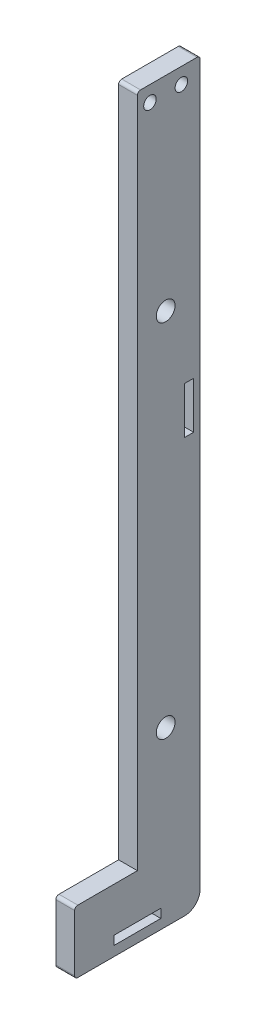
ISO-10303-21;
HEADER;
FILE_DESCRIPTION(('STEP AP214'),'2;1');
FILE_NAME('part.step','',(''),(''),'','','');
FILE_SCHEMA(('AUTOMOTIVE_DESIGN { 1 0 10303 214 1 1 1 1 }'));
ENDSEC;
DATA;
#1=APPLICATION_CONTEXT('core data for automotive mechanical design processes');
#2=APPLICATION_PROTOCOL_DEFINITION('international standard','automotive_design',2000,#1);
#3=PRODUCT_CONTEXT('',#1,'mechanical');
#4=PRODUCT('Part','Part','',(#3));
#5=PRODUCT_RELATED_PRODUCT_CATEGORY('part','',(#4));
#6=PRODUCT_DEFINITION_FORMATION('','',#4);
#7=PRODUCT_DEFINITION_CONTEXT('part definition',#1,'design');
#8=PRODUCT_DEFINITION('design','',#6,#7);
#9=PRODUCT_DEFINITION_SHAPE('','',#8);
#10=(LENGTH_UNIT() NAMED_UNIT(*) SI_UNIT(.MILLI.,.METRE.));
#11=(NAMED_UNIT(*) PLANE_ANGLE_UNIT() SI_UNIT($,.RADIAN.));
#12=(NAMED_UNIT(*) SI_UNIT($,.STERADIAN.) SOLID_ANGLE_UNIT());
#13=UNCERTAINTY_MEASURE_WITH_UNIT(LENGTH_MEASURE(1.E-05),#10,'distance_accuracy_value','');
#14=(GEOMETRIC_REPRESENTATION_CONTEXT(3) GLOBAL_UNCERTAINTY_ASSIGNED_CONTEXT((#13)) GLOBAL_UNIT_ASSIGNED_CONTEXT((#10,
#11,#12)) REPRESENTATION_CONTEXT('',''));
#15=CARTESIAN_POINT('',(0.,0.,0.));
#16=DIRECTION('',(0.,0.,1.));
#17=DIRECTION('',(1.,0.,0.));
#18=AXIS2_PLACEMENT_3D('',#15,#16,#17);
#19=CARTESIAN_POINT('',(6.,-88.05,0.));
#20=DIRECTION('',(0.,1.,0.));
#21=DIRECTION('',(0.,0.,1.));
#22=AXIS2_PLACEMENT_3D('',#19,#20,#21);
#23=PLANE('',#22);
#24=DIRECTION('',(0.,0.,-1.));
#25=VECTOR('',#24,1.);
#26=CARTESIAN_POINT('',(0.,-88.05,0.));
#27=LINE('',#26,#25);
#28=CARTESIAN_POINT('',(0.,-88.05,4.915));
#29=VERTEX_POINT('',#28);
#30=CARTESIAN_POINT('',(0.,-88.05,2.085));
#31=VERTEX_POINT('',#30);
#32=EDGE_CURVE('E294',#29,#31,#27,.T.);
#33=ORIENTED_EDGE('',*,*,#32,.T.);
#34=DIRECTION('',(-1.,0.,0.));
#35=VECTOR('',#34,1.);
#36=CARTESIAN_POINT('',(6.,-88.05,2.085));
#37=LINE('',#36,#35);
#38=CARTESIAN_POINT('',(6.,-88.05,2.085));
#39=VERTEX_POINT('',#38);
#40=EDGE_CURVE('E321',#39,#31,#37,.T.);
#41=ORIENTED_EDGE('',*,*,#40,.F.);
#42=DIRECTION('',(0.,0.,-1.));
#43=VECTOR('',#42,1.);
#44=CARTESIAN_POINT('',(6.,-88.05,0.));
#45=LINE('',#44,#43);
#46=CARTESIAN_POINT('',(6.,-88.05,4.915));
#47=VERTEX_POINT('',#46);
#48=EDGE_CURVE('E229',#47,#39,#45,.T.);
#49=ORIENTED_EDGE('',*,*,#48,.F.);
#50=DIRECTION('',(-1.,0.,0.));
#51=VECTOR('',#50,1.);
#52=CARTESIAN_POINT('',(6.,-88.05,4.915));
#53=LINE('',#52,#51);
#54=EDGE_CURVE('E311',#47,#29,#53,.T.);
#55=ORIENTED_EDGE('',*,*,#54,.T.);
#56=EDGE_LOOP('',(#33,#41,#49,#55));
#57=FACE_BOUND('',#56,.T.);
#58=ADVANCED_FACE('F43',(#57),#23,.F.);
#59=CARTESIAN_POINT('',(6.,0.,2.08500000000001));
#60=DIRECTION('',(0.,0.,-1.));
#61=DIRECTION('',(0.,1.,0.));
#62=AXIS2_PLACEMENT_3D('',#59,#60,#61);
#63=PLANE('',#62);
#64=DIRECTION('',(0.,-1.,0.));
#65=VECTOR('',#64,1.);
#66=CARTESIAN_POINT('',(0.,0.,2.08500000000001));
#67=LINE('',#66,#65);
#68=CARTESIAN_POINT('',(0.,-102.95,2.085));
#69=VERTEX_POINT('',#68);
#70=EDGE_CURVE('E298',#31,#69,#67,.T.);
#71=ORIENTED_EDGE('',*,*,#70,.T.);
#72=DIRECTION('',(-1.,0.,0.));
#73=VECTOR('',#72,1.);
#74=CARTESIAN_POINT('',(6.,-102.95,2.085));
#75=LINE('',#74,#73);
#76=CARTESIAN_POINT('',(6.,-102.95,2.085));
#77=VERTEX_POINT('',#76);
#78=EDGE_CURVE('E318',#77,#69,#75,.T.);
#79=ORIENTED_EDGE('',*,*,#78,.F.);
#80=DIRECTION('',(0.,-1.,0.));
#81=VECTOR('',#80,1.);
#82=CARTESIAN_POINT('',(6.,0.,2.08500000000001));
#83=LINE('',#82,#81);
#84=EDGE_CURVE('E233',#39,#77,#83,.T.);
#85=ORIENTED_EDGE('',*,*,#84,.F.);
#86=ORIENTED_EDGE('',*,*,#40,.T.);
#87=EDGE_LOOP('',(#71,#79,#85,#86));
#88=FACE_BOUND('',#87,.T.);
#89=ADVANCED_FACE('F467',(#88),#63,.F.);
#90=CARTESIAN_POINT('',(6.,-102.95,0.));
#91=DIRECTION('',(0.,1.,0.));
#92=DIRECTION('',(0.,0.,1.));
#93=AXIS2_PLACEMENT_3D('',#90,#91,#92);
#94=PLANE('',#93);
#95=DIRECTION('',(0.,0.,-1.));
#96=VECTOR('',#95,1.);
#97=CARTESIAN_POINT('',(0.,-102.95,0.));
#98=LINE('',#97,#96);
#99=CARTESIAN_POINT('',(0.,-102.95,4.915));
#100=VERTEX_POINT('',#99);
#101=EDGE_CURVE('E302',#100,#69,#98,.T.);
#102=ORIENTED_EDGE('',*,*,#101,.F.);
#103=DIRECTION('',(-1.,0.,0.));
#104=VECTOR('',#103,1.);
#105=CARTESIAN_POINT('',(6.,-102.95,4.915));
#106=LINE('',#105,#104);
#107=CARTESIAN_POINT('',(6.,-102.95,4.915));
#108=VERTEX_POINT('',#107);
#109=EDGE_CURVE('E314',#108,#100,#106,.T.);
#110=ORIENTED_EDGE('',*,*,#109,.F.);
#111=DIRECTION('',(0.,0.,-1.));
#112=VECTOR('',#111,1.);
#113=CARTESIAN_POINT('',(6.,-102.95,0.));
#114=LINE('',#113,#112);
#115=EDGE_CURVE('E236',#108,#77,#114,.T.);
#116=ORIENTED_EDGE('',*,*,#115,.T.);
#117=ORIENTED_EDGE('',*,*,#78,.T.);
#118=EDGE_LOOP('',(#102,#110,#116,#117));
#119=FACE_BOUND('',#118,.T.);
#120=ADVANCED_FACE('F473',(#119),#94,.T.);
#121=CARTESIAN_POINT('',(6.,-229.095,0.));
#122=DIRECTION('',(0.,1.,0.));
#123=DIRECTION('',(0.,0.,1.));
#124=AXIS2_PLACEMENT_3D('',#121,#122,#123);
#125=PLANE('',#124);
#126=DIRECTION('',(0.,0.,-1.));
#127=VECTOR('',#126,1.);
#128=CARTESIAN_POINT('',(0.,-229.095,0.));
#129=LINE('',#128,#127);
#130=CARTESIAN_POINT('',(0.,-229.095,27.4499999999999));
#131=VERTEX_POINT('',#130);
#132=CARTESIAN_POINT('',(0.,-229.095,12.5499999999998));
#133=VERTEX_POINT('',#132);
#134=EDGE_CURVE('E278',#131,#133,#129,.T.);
#135=ORIENTED_EDGE('',*,*,#134,.T.);
#136=DIRECTION('',(-1.,0.,0.));
#137=VECTOR('',#136,1.);
#138=CARTESIAN_POINT('',(6.,-229.095,12.5499999999998));
#139=LINE('',#138,#137);
#140=CARTESIAN_POINT('',(6.,-229.095,12.5499999999998));
#141=VERTEX_POINT('',#140);
#142=EDGE_CURVE('E315',#141,#133,#139,.T.);
#143=ORIENTED_EDGE('',*,*,#142,.F.);
#144=DIRECTION('',(0.,0.,-1.));
#145=VECTOR('',#144,1.);
#146=CARTESIAN_POINT('',(6.,-229.095,0.));
#147=LINE('',#146,#145);
#148=CARTESIAN_POINT('',(6.,-229.095,27.4499999999999));
#149=VERTEX_POINT('',#148);
#150=EDGE_CURVE('E211',#149,#141,#147,.T.);
#151=ORIENTED_EDGE('',*,*,#150,.F.);
#152=DIRECTION('',(-1.,0.,0.));
#153=VECTOR('',#152,1.);
#154=CARTESIAN_POINT('',(6.,-229.095,27.4499999999999));
#155=LINE('',#154,#153);
#156=EDGE_CURVE('E200',#149,#131,#155,.T.);
#157=ORIENTED_EDGE('',*,*,#156,.T.);
#158=EDGE_LOOP('',(#135,#143,#151,#157));
#159=FACE_BOUND('',#158,.T.);
#160=ADVANCED_FACE('F490',(#159),#125,.F.);
#161=CARTESIAN_POINT('',(6.,0.,12.5499999999998));
#162=DIRECTION('',(0.,0.,-1.));
#163=DIRECTION('',(-1.,0.,0.));
#164=AXIS2_PLACEMENT_3D('',#161,#162,#163);
#165=PLANE('',#164);
#166=DIRECTION('',(0.,-1.,0.));
#167=VECTOR('',#166,1.);
#168=CARTESIAN_POINT('',(0.,0.,12.5499999999998));
#169=LINE('',#168,#167);
#170=CARTESIAN_POINT('',(0.,-231.905,12.5499999999998));
#171=VERTEX_POINT('',#170);
#172=EDGE_CURVE('E282',#133,#171,#169,.T.);
#173=ORIENTED_EDGE('',*,*,#172,.T.);
#174=DIRECTION('',(-1.,0.,0.));
#175=VECTOR('',#174,1.);
#176=CARTESIAN_POINT('',(6.,-231.905,12.5499999999998));
#177=LINE('',#176,#175);
#178=CARTESIAN_POINT('',(6.,-231.905,12.5499999999998));
#179=VERTEX_POINT('',#178);
#180=EDGE_CURVE('E331',#179,#171,#177,.T.);
#181=ORIENTED_EDGE('',*,*,#180,.F.);
#182=DIRECTION('',(0.,-1.,0.));
#183=VECTOR('',#182,1.);
#184=CARTESIAN_POINT('',(6.,0.,12.5499999999998));
#185=LINE('',#184,#183);
#186=EDGE_CURVE('E218',#141,#179,#185,.T.);
#187=ORIENTED_EDGE('',*,*,#186,.F.);
#188=ORIENTED_EDGE('',*,*,#142,.T.);
#189=EDGE_LOOP('',(#173,#181,#187,#188));
#190=FACE_BOUND('',#189,.T.);
#191=ADVANCED_FACE('F486',(#190),#165,.F.);
#192=CARTESIAN_POINT('',(6.,-231.905,0.));
#193=DIRECTION('',(0.,1.,0.));
#194=DIRECTION('',(0.,0.,1.));
#195=AXIS2_PLACEMENT_3D('',#192,#193,#194);
#196=PLANE('',#195);
#197=DIRECTION('',(0.,0.,-1.));
#198=VECTOR('',#197,1.);
#199=CARTESIAN_POINT('',(0.,-231.905,0.));
#200=LINE('',#199,#198);
#201=CARTESIAN_POINT('',(0.,-231.905,27.4499999999999));
#202=VERTEX_POINT('',#201);
#203=EDGE_CURVE('E286',#202,#171,#200,.T.);
#204=ORIENTED_EDGE('',*,*,#203,.F.);
#205=DIRECTION('',(-1.,0.,0.));
#206=VECTOR('',#205,1.);
#207=CARTESIAN_POINT('',(6.,-231.905,27.4499999999999));
#208=LINE('',#207,#206);
#209=CARTESIAN_POINT('',(6.,-231.905,27.4499999999999));
#210=VERTEX_POINT('',#209);
#211=EDGE_CURVE('E328',#210,#202,#208,.T.);
#212=ORIENTED_EDGE('',*,*,#211,.F.);
#213=DIRECTION('',(0.,0.,-1.));
#214=VECTOR('',#213,1.);
#215=CARTESIAN_POINT('',(6.,-231.905,0.));
#216=LINE('',#215,#214);
#217=EDGE_CURVE('E221',#210,#179,#216,.T.);
#218=ORIENTED_EDGE('',*,*,#217,.T.);
#219=ORIENTED_EDGE('',*,*,#180,.T.);
#220=EDGE_LOOP('',(#204,#212,#218,#219));
#221=FACE_BOUND('',#220,.T.);
#222=ADVANCED_FACE('F482',(#221),#196,.T.);
#223=CARTESIAN_POINT('',(6.,-235.,0.));
#224=DIRECTION('',(0.,1.,0.));
#225=DIRECTION('',(0.,0.,1.));
#226=AXIS2_PLACEMENT_3D('',#223,#224,#225);
#227=PLANE('',#226);
#228=DIRECTION('',(0.,0.,-1.));
#229=VECTOR('',#228,1.);
#230=CARTESIAN_POINT('',(0.,-235.,0.));
#231=LINE('',#230,#229);
#232=CARTESIAN_POINT('',(0.,-235.,39.));
#233=VERTEX_POINT('',#232);
#234=CARTESIAN_POINT('',(0.,-235.,5.));
#235=VERTEX_POINT('',#234);
#236=EDGE_CURVE('E259',#233,#235,#231,.T.);
#237=ORIENTED_EDGE('',*,*,#236,.T.);
#238=DIRECTION('',(-1.,0.,0.));
#239=VECTOR('',#238,1.);
#240=CARTESIAN_POINT('',(6.,-235.,5.));
#241=LINE('',#240,#239);
#242=CARTESIAN_POINT('',(6.,-235.,5.));
#243=VERTEX_POINT('',#242);
#244=EDGE_CURVE('E52',#235,#243,#241,.F.);
#245=ORIENTED_EDGE('',*,*,#244,.T.);
#246=DIRECTION('',(0.,0.,-1.));
#247=VECTOR('',#246,1.);
#248=CARTESIAN_POINT('',(6.,-235.,0.));
#249=LINE('',#248,#247);
#250=CARTESIAN_POINT('',(6.,-235.,39.));
#251=VERTEX_POINT('',#250);
#252=EDGE_CURVE('E414',#251,#243,#249,.T.);
#253=ORIENTED_EDGE('',*,*,#252,.F.);
#254=DIRECTION('',(-1.,0.,0.));
#255=VECTOR('',#254,1.);
#256=CARTESIAN_POINT('',(6.,-235.,39.));
#257=LINE('',#256,#255);
#258=EDGE_CURVE('E383',#251,#233,#257,.T.);
#259=ORIENTED_EDGE('',*,*,#258,.T.);
#260=EDGE_LOOP('',(#237,#245,#253,#259));
#261=FACE_BOUND('',#260,.T.);
#262=ADVANCED_FACE('F485',(#261),#227,.F.);
#263=CARTESIAN_POINT('',(6.,0.,0.));
#264=DIRECTION('',(0.,0.,1.));
#265=DIRECTION('',(1.,0.,0.));
#266=AXIS2_PLACEMENT_3D('',#263,#264,#265);
#267=PLANE('',#266);
#268=DIRECTION('',(0.,1.,0.));
#269=VECTOR('',#268,1.);
#270=CARTESIAN_POINT('',(6.,0.,0.));
#271=LINE('',#270,#269);
#272=CARTESIAN_POINT('',(6.,-230.,0.));
#273=VERTEX_POINT('',#272);
#274=CARTESIAN_POINT('',(6.,-1.,0.));
#275=VERTEX_POINT('',#274);
#276=EDGE_CURVE('E397',#273,#275,#271,.T.);
#277=ORIENTED_EDGE('',*,*,#276,.F.);
#278=DIRECTION('',(-1.,0.,0.));
#279=VECTOR('',#278,1.);
#280=CARTESIAN_POINT('',(6.,-230.,0.));
#281=LINE('',#280,#279);
#282=CARTESIAN_POINT('',(0.,-230.,0.));
#283=VERTEX_POINT('',#282);
#284=EDGE_CURVE('E387',#273,#283,#281,.T.);
#285=ORIENTED_EDGE('',*,*,#284,.T.);
#286=DIRECTION('',(0.,1.,0.));
#287=VECTOR('',#286,1.);
#288=CARTESIAN_POINT('',(0.,0.,0.));
#289=LINE('',#288,#287);
#290=CARTESIAN_POINT('',(0.,-1.,0.));
#291=VERTEX_POINT('',#290);
#292=EDGE_CURVE('E262',#283,#291,#289,.T.);
#293=ORIENTED_EDGE('',*,*,#292,.T.);
#294=DIRECTION('',(-1.,0.,0.));
#295=VECTOR('',#294,1.);
#296=CARTESIAN_POINT('',(6.,-1.,0.));
#297=LINE('',#296,#295);
#298=EDGE_CURVE('E356',#291,#275,#297,.F.);
#299=ORIENTED_EDGE('',*,*,#298,.T.);
#300=EDGE_LOOP('',(#277,#285,#293,#299));
#301=FACE_BOUND('',#300,.T.);
#302=ADVANCED_FACE('F396',(#301),#267,.F.);
#303=CARTESIAN_POINT('',(6.,0.,0.));
#304=DIRECTION('',(0.,-1.,0.));
#305=DIRECTION('',(0.,0.,-1.));
#306=AXIS2_PLACEMENT_3D('',#303,#304,#305);
#307=PLANE('',#306);
#308=DIRECTION('',(0.,0.,1.));
#309=VECTOR('',#308,1.);
#310=CARTESIAN_POINT('',(6.,0.,0.));
#311=LINE('',#310,#309);
#312=CARTESIAN_POINT('',(6.,0.,1.));
#313=VERTEX_POINT('',#312);
#314=CARTESIAN_POINT('',(6.,0.,19.));
#315=VERTEX_POINT('',#314);
#316=EDGE_CURVE('E189',#313,#315,#311,.T.);
#317=ORIENTED_EDGE('',*,*,#316,.F.);
#318=DIRECTION('',(-1.,0.,0.));
#319=VECTOR('',#318,1.);
#320=CARTESIAN_POINT('',(6.,0.,1.));
#321=LINE('',#320,#319);
#322=CARTESIAN_POINT('',(0.,0.,1.));
#323=VERTEX_POINT('',#322);
#324=EDGE_CURVE('E339',#313,#323,#321,.T.);
#325=ORIENTED_EDGE('',*,*,#324,.T.);
#326=DIRECTION('',(0.,0.,1.));
#327=VECTOR('',#326,1.);
#328=CARTESIAN_POINT('',(0.,0.,0.));
#329=LINE('',#328,#327);
#330=CARTESIAN_POINT('',(0.,0.,19.));
#331=VERTEX_POINT('',#330);
#332=EDGE_CURVE('E265',#323,#331,#329,.T.);
#333=ORIENTED_EDGE('',*,*,#332,.T.);
#334=DIRECTION('',(-1.,0.,0.));
#335=VECTOR('',#334,1.);
#336=CARTESIAN_POINT('',(6.,0.,19.));
#337=LINE('',#336,#335);
#338=EDGE_CURVE('E325',#331,#315,#337,.F.);
#339=ORIENTED_EDGE('',*,*,#338,.T.);
#340=EDGE_LOOP('',(#317,#325,#333,#339));
#341=FACE_BOUND('',#340,.T.);
#342=ADVANCED_FACE('F410',(#341),#307,.F.);
#343=CARTESIAN_POINT('',(6.,0.,20.));
#344=DIRECTION('',(0.,0.,-1.));
#345=DIRECTION('',(0.,1.,0.));
#346=AXIS2_PLACEMENT_3D('',#343,#344,#345);
#347=PLANE('',#346);
#348=DIRECTION('',(0.,-1.,0.));
#349=VECTOR('',#348,1.);
#350=CARTESIAN_POINT('',(6.,0.,20.));
#351=LINE('',#350,#349);
#352=CARTESIAN_POINT('',(6.,-1.,20.));
#353=VERTEX_POINT('',#352);
#354=CARTESIAN_POINT('',(6.,-215.,20.));
#355=VERTEX_POINT('',#354);
#356=EDGE_CURVE('E175',#353,#355,#351,.T.);
#357=ORIENTED_EDGE('',*,*,#356,.F.);
#358=DIRECTION('',(-1.,0.,0.));
#359=VECTOR('',#358,1.);
#360=CARTESIAN_POINT('',(6.,-1.,20.));
#361=LINE('',#360,#359);
#362=CARTESIAN_POINT('',(0.,-1.,20.));
#363=VERTEX_POINT('',#362);
#364=EDGE_CURVE('E371',#353,#363,#361,.T.);
#365=ORIENTED_EDGE('',*,*,#364,.T.);
#366=DIRECTION('',(0.,-1.,0.));
#367=VECTOR('',#366,1.);
#368=CARTESIAN_POINT('',(0.,0.,20.));
#369=LINE('',#368,#367);
#370=CARTESIAN_POINT('',(0.,-215.,20.));
#371=VERTEX_POINT('',#370);
#372=EDGE_CURVE('E195',#363,#371,#369,.T.);
#373=ORIENTED_EDGE('',*,*,#372,.T.);
#374=DIRECTION('',(-1.,0.,0.));
#375=VECTOR('',#374,1.);
#376=CARTESIAN_POINT('',(6.,-215.,20.));
#377=LINE('',#376,#375);
#378=EDGE_CURVE('E192',#355,#371,#377,.T.);
#379=ORIENTED_EDGE('',*,*,#378,.F.);
#380=EDGE_LOOP('',(#357,#365,#373,#379));
#381=FACE_BOUND('',#380,.T.);
#382=ADVANCED_FACE('F193',(#381),#347,.F.);
#383=CARTESIAN_POINT('',(6.,-215.,0.));
#384=DIRECTION('',(0.,-1.,0.));
#385=DIRECTION('',(0.,0.,-1.));
#386=AXIS2_PLACEMENT_3D('',#383,#384,#385);
#387=PLANE('',#386);
#388=DIRECTION('',(0.,0.,1.));
#389=VECTOR('',#388,1.);
#390=CARTESIAN_POINT('',(0.,-215.,0.));
#391=LINE('',#390,#389);
#392=CARTESIAN_POINT('',(0.,-215.,39.));
#393=VERTEX_POINT('',#392);
#394=EDGE_CURVE('E271',#371,#393,#391,.T.);
#395=ORIENTED_EDGE('',*,*,#394,.T.);
#396=DIRECTION('',(-1.,0.,0.));
#397=VECTOR('',#396,1.);
#398=CARTESIAN_POINT('',(6.,-215.,39.));
#399=LINE('',#398,#397);
#400=CARTESIAN_POINT('',(6.,-215.,39.));
#401=VERTEX_POINT('',#400);
#402=EDGE_CURVE('E205',#393,#401,#399,.F.);
#403=ORIENTED_EDGE('',*,*,#402,.T.);
#404=DIRECTION('',(0.,0.,1.));
#405=VECTOR('',#404,1.);
#406=CARTESIAN_POINT('',(6.,-215.,0.));
#407=LINE('',#406,#405);
#408=EDGE_CURVE('E180',#355,#401,#407,.T.);
#409=ORIENTED_EDGE('',*,*,#408,.F.);
#410=ORIENTED_EDGE('',*,*,#378,.T.);
#411=EDGE_LOOP('',(#395,#403,#409,#410));
#412=FACE_BOUND('',#411,.T.);
#413=ADVANCED_FACE('F203',(#412),#387,.F.);
#414=CARTESIAN_POINT('',(6.,0.,27.4499999999999));
#415=DIRECTION('',(0.,0.,-1.));
#416=DIRECTION('',(-1.,0.,0.));
#417=AXIS2_PLACEMENT_3D('',#414,#415,#416);
#418=PLANE('',#417);
#419=DIRECTION('',(0.,-1.,0.));
#420=VECTOR('',#419,1.);
#421=CARTESIAN_POINT('',(0.,0.,27.4499999999999));
#422=LINE('',#421,#420);
#423=EDGE_CURVE('E290',#131,#202,#422,.T.);
#424=ORIENTED_EDGE('',*,*,#423,.F.);
#425=ORIENTED_EDGE('',*,*,#156,.F.);
#426=DIRECTION('',(0.,-1.,0.));
#427=VECTOR('',#426,1.);
#428=CARTESIAN_POINT('',(6.,0.,27.4499999999999));
#429=LINE('',#428,#427);
#430=EDGE_CURVE('E225',#149,#210,#429,.T.);
#431=ORIENTED_EDGE('',*,*,#430,.T.);
#432=ORIENTED_EDGE('',*,*,#211,.T.);
#433=EDGE_LOOP('',(#424,#425,#431,#432));
#434=FACE_BOUND('',#433,.T.);
#435=ADVANCED_FACE('F478',(#434),#418,.T.);
#436=CARTESIAN_POINT('',(6.,0.,40.0000000000001));
#437=DIRECTION('',(0.,0.,-1.));
#438=DIRECTION('',(0.,1.,0.));
#439=AXIS2_PLACEMENT_3D('',#436,#437,#438);
#440=PLANE('',#439);
#441=DIRECTION('',(0.,-1.,0.));
#442=VECTOR('',#441,1.);
#443=CARTESIAN_POINT('',(6.,0.,40.0000000000001));
#444=LINE('',#443,#442);
#445=CARTESIAN_POINT('',(6.,-216.,40.));
#446=VERTEX_POINT('',#445);
#447=CARTESIAN_POINT('',(6.,-234.,40.));
#448=VERTEX_POINT('',#447);
#449=EDGE_CURVE('E207',#446,#448,#444,.T.);
#450=ORIENTED_EDGE('',*,*,#449,.F.);
#451=DIRECTION('',(-1.,0.,0.));
#452=VECTOR('',#451,1.);
#453=CARTESIAN_POINT('',(6.,-216.,40.));
#454=LINE('',#453,#452);
#455=CARTESIAN_POINT('',(0.,-216.,40.));
#456=VERTEX_POINT('',#455);
#457=EDGE_CURVE('E377',#446,#456,#454,.T.);
#458=ORIENTED_EDGE('',*,*,#457,.T.);
#459=DIRECTION('',(0.,-1.,0.));
#460=VECTOR('',#459,1.);
#461=CARTESIAN_POINT('',(0.,0.,40.0000000000001));
#462=LINE('',#461,#460);
#463=CARTESIAN_POINT('',(0.,-234.,40.));
#464=VERTEX_POINT('',#463);
#465=EDGE_CURVE('E274',#456,#464,#462,.T.);
#466=ORIENTED_EDGE('',*,*,#465,.T.);
#467=DIRECTION('',(-1.,0.,0.));
#468=VECTOR('',#467,1.);
#469=CARTESIAN_POINT('',(6.,-234.,40.));
#470=LINE('',#469,#468);
#471=EDGE_CURVE('E374',#464,#448,#470,.F.);
#472=ORIENTED_EDGE('',*,*,#471,.T.);
#473=EDGE_LOOP('',(#450,#458,#466,#472));
#474=FACE_BOUND('',#473,.T.);
#475=ADVANCED_FACE('F452',(#474),#440,.F.);
#476=CARTESIAN_POINT('',(6.,-5.,16.));
#477=DIRECTION('',(-1.,0.,0.));
#478=DIRECTION('',(0.,0.,1.));
#479=AXIS2_PLACEMENT_3D('',#476,#477,#478);
#480=CYLINDRICAL_SURFACE('',#479,2.);
#481=CARTESIAN_POINT('',(6.,-5.,16.));
#482=DIRECTION('',(1.,0.,0.));
#483=DIRECTION('',(0.,0.,-1.));
#484=AXIS2_PLACEMENT_3D('',#481,#482,#483);
#485=CIRCLE('',#484,2.);
#486=CARTESIAN_POINT('',(6.,-5.,14.));
#487=VERTEX_POINT('',#486);
#488=EDGE_CURVE('E419',#487,#487,#485,.T.);
#489=ORIENTED_EDGE('',*,*,#488,.T.);
#490=EDGE_LOOP('',(#489));
#491=FACE_BOUND('',#490,.T.);
#492=CARTESIAN_POINT('',(0.,-5.,16.));
#493=DIRECTION('',(1.,0.,0.));
#494=DIRECTION('',(0.,0.,-1.));
#495=AXIS2_PLACEMENT_3D('',#492,#493,#494);
#496=CIRCLE('',#495,2.);
#497=CARTESIAN_POINT('',(0.,-5.,14.));
#498=VERTEX_POINT('',#497);
#499=EDGE_CURVE('E255',#498,#498,#496,.T.);
#500=ORIENTED_EDGE('',*,*,#499,.F.);
#501=EDGE_LOOP('',(#500));
#502=FACE_BOUND('',#501,.T.);
#503=ADVANCED_FACE('F448',(#491,#502),#480,.F.);
#504=CARTESIAN_POINT('',(6.,-5.,6.));
#505=DIRECTION('',(-1.,0.,0.));
#506=DIRECTION('',(0.,0.,1.));
#507=AXIS2_PLACEMENT_3D('',#504,#505,#506);
#508=CYLINDRICAL_SURFACE('',#507,2.);
#509=CARTESIAN_POINT('',(6.,-5.,6.));
#510=DIRECTION('',(1.,0.,0.));
#511=DIRECTION('',(0.,0.,-1.));
#512=AXIS2_PLACEMENT_3D('',#509,#510,#511);
#513=CIRCLE('',#512,2.);
#514=CARTESIAN_POINT('',(6.,-5.,4.));
#515=VERTEX_POINT('',#514);
#516=EDGE_CURVE('E423',#515,#515,#513,.T.);
#517=ORIENTED_EDGE('',*,*,#516,.T.);
#518=EDGE_LOOP('',(#517));
#519=FACE_BOUND('',#518,.T.);
#520=CARTESIAN_POINT('',(0.,-5.,6.));
#521=DIRECTION('',(1.,0.,0.));
#522=DIRECTION('',(0.,0.,-1.));
#523=AXIS2_PLACEMENT_3D('',#520,#521,#522);
#524=CIRCLE('',#523,2.);
#525=CARTESIAN_POINT('',(0.,-5.,4.));
#526=VERTEX_POINT('',#525);
#527=EDGE_CURVE('E251',#526,#526,#524,.T.);
#528=ORIENTED_EDGE('',*,*,#527,.F.);
#529=EDGE_LOOP('',(#528));
#530=FACE_BOUND('',#529,.T.);
#531=ADVANCED_FACE('F451',(#519,#530),#508,.F.);
#532=CARTESIAN_POINT('',(6.,-65.,11.));
#533=DIRECTION('',(-1.,0.,0.));
#534=DIRECTION('',(0.,0.,1.));
#535=AXIS2_PLACEMENT_3D('',#532,#533,#534);
#536=CYLINDRICAL_SURFACE('',#535,3.);
#537=CARTESIAN_POINT('',(6.,-65.,11.));
#538=DIRECTION('',(1.,0.,0.));
#539=DIRECTION('',(0.,0.,-1.));
#540=AXIS2_PLACEMENT_3D('',#537,#538,#539);
#541=CIRCLE('',#540,3.);
#542=CARTESIAN_POINT('',(6.,-65.,8.));
#543=VERTEX_POINT('',#542);
#544=EDGE_CURVE('E427',#543,#543,#541,.T.);
#545=ORIENTED_EDGE('',*,*,#544,.T.);
#546=EDGE_LOOP('',(#545));
#547=FACE_BOUND('',#546,.T.);
#548=CARTESIAN_POINT('',(0.,-65.,11.));
#549=DIRECTION('',(1.,0.,0.));
#550=DIRECTION('',(0.,0.,-1.));
#551=AXIS2_PLACEMENT_3D('',#548,#549,#550);
#552=CIRCLE('',#551,3.);
#553=CARTESIAN_POINT('',(0.,-65.,8.));
#554=VERTEX_POINT('',#553);
#555=EDGE_CURVE('E247',#554,#554,#552,.T.);
#556=ORIENTED_EDGE('',*,*,#555,.F.);
#557=EDGE_LOOP('',(#556));
#558=FACE_BOUND('',#557,.T.);
#559=ADVANCED_FACE('F510',(#547,#558),#536,.F.);
#560=CARTESIAN_POINT('',(6.,-180.,10.9999999999988));
#561=DIRECTION('',(-1.,0.,0.));
#562=DIRECTION('',(0.,0.,1.));
#563=AXIS2_PLACEMENT_3D('',#560,#561,#562);
#564=CYLINDRICAL_SURFACE('',#563,3.);
#565=CARTESIAN_POINT('',(6.,-180.,10.9999999999988));
#566=DIRECTION('',(1.,0.,0.));
#567=DIRECTION('',(0.,0.,-1.));
#568=AXIS2_PLACEMENT_3D('',#565,#566,#567);
#569=CIRCLE('',#568,3.);
#570=CARTESIAN_POINT('',(6.,-180.,7.99999999999879));
#571=VERTEX_POINT('',#570);
#572=EDGE_CURVE('E310',#571,#571,#569,.T.);
#573=ORIENTED_EDGE('',*,*,#572,.T.);
#574=EDGE_LOOP('',(#573));
#575=FACE_BOUND('',#574,.T.);
#576=CARTESIAN_POINT('',(0.,-180.,10.9999999999988));
#577=DIRECTION('',(1.,0.,0.));
#578=DIRECTION('',(0.,0.,-1.));
#579=AXIS2_PLACEMENT_3D('',#576,#577,#578);
#580=CIRCLE('',#579,3.);
#581=CARTESIAN_POINT('',(0.,-180.,7.99999999999879));
#582=VERTEX_POINT('',#581);
#583=EDGE_CURVE('E243',#582,#582,#580,.T.);
#584=ORIENTED_EDGE('',*,*,#583,.F.);
#585=EDGE_LOOP('',(#584));
#586=FACE_BOUND('',#585,.T.);
#587=ADVANCED_FACE('F435',(#575,#586),#564,.F.);
#588=CARTESIAN_POINT('',(6.,0.,4.91500000000001));
#589=DIRECTION('',(0.,0.,-1.));
#590=DIRECTION('',(0.,1.,0.));
#591=AXIS2_PLACEMENT_3D('',#588,#589,#590);
#592=PLANE('',#591);
#593=DIRECTION('',(0.,-1.,0.));
#594=VECTOR('',#593,1.);
#595=CARTESIAN_POINT('',(0.,0.,4.91500000000001));
#596=LINE('',#595,#594);
#597=EDGE_CURVE('E306',#29,#100,#596,.T.);
#598=ORIENTED_EDGE('',*,*,#597,.F.);
#599=ORIENTED_EDGE('',*,*,#54,.F.);
#600=DIRECTION('',(0.,-1.,0.));
#601=VECTOR('',#600,1.);
#602=CARTESIAN_POINT('',(6.,0.,4.91500000000001));
#603=LINE('',#602,#601);
#604=EDGE_CURVE('E201',#47,#108,#603,.T.);
#605=ORIENTED_EDGE('',*,*,#604,.T.);
#606=ORIENTED_EDGE('',*,*,#109,.T.);
#607=EDGE_LOOP('',(#598,#599,#605,#606));
#608=FACE_BOUND('',#607,.T.);
#609=ADVANCED_FACE('F440',(#608),#592,.T.);
#610=CARTESIAN_POINT('',(6.,0.,0.));
#611=DIRECTION('',(1.,0.,0.));
#612=DIRECTION('',(0.,0.,-1.));
#613=AXIS2_PLACEMENT_3D('',#610,#611,#612);
#614=PLANE('',#613);
#615=ORIENTED_EDGE('',*,*,#572,.F.);
#616=EDGE_LOOP('',(#615));
#617=FACE_BOUND('',#616,.T.);
#618=ORIENTED_EDGE('',*,*,#544,.F.);
#619=EDGE_LOOP('',(#618));
#620=FACE_BOUND('',#619,.T.);
#621=ORIENTED_EDGE('',*,*,#516,.F.);
#622=EDGE_LOOP('',(#621));
#623=FACE_BOUND('',#622,.T.);
#624=ORIENTED_EDGE('',*,*,#488,.F.);
#625=EDGE_LOOP('',(#624));
#626=FACE_BOUND('',#625,.T.);
#627=ORIENTED_EDGE('',*,*,#252,.T.);
#628=CARTESIAN_POINT('',(6.,-230.,5.));
#629=DIRECTION('',(1.,0.,0.));
#630=DIRECTION('',(0.,0.,-1.));
#631=AXIS2_PLACEMENT_3D('',#628,#629,#630);
#632=CIRCLE('',#631,5.);
#633=EDGE_CURVE('E11',#243,#273,#632,.T.);
#634=ORIENTED_EDGE('',*,*,#633,.T.);
#635=ORIENTED_EDGE('',*,*,#276,.T.);
#636=CARTESIAN_POINT('',(6.,-1.,1.));
#637=DIRECTION('',(1.,0.,0.));
#638=DIRECTION('',(0.,0.,-1.));
#639=AXIS2_PLACEMENT_3D('',#636,#637,#638);
#640=CIRCLE('',#639,1.);
#641=EDGE_CURVE('E368',#275,#313,#640,.T.);
#642=ORIENTED_EDGE('',*,*,#641,.T.);
#643=ORIENTED_EDGE('',*,*,#316,.T.);
#644=CARTESIAN_POINT('',(6.,-1.,19.));
#645=DIRECTION('',(1.,0.,0.));
#646=DIRECTION('',(0.,0.,-1.));
#647=AXIS2_PLACEMENT_3D('',#644,#645,#646);
#648=CIRCLE('',#647,1.);
#649=EDGE_CURVE('E184',#315,#353,#648,.T.);
#650=ORIENTED_EDGE('',*,*,#649,.T.);
#651=ORIENTED_EDGE('',*,*,#356,.T.);
#652=ORIENTED_EDGE('',*,*,#408,.T.);
#653=CARTESIAN_POINT('',(6.,-216.,39.));
#654=DIRECTION('',(1.,0.,0.));
#655=DIRECTION('',(0.,0.,-1.));
#656=AXIS2_PLACEMENT_3D('',#653,#654,#655);
#657=CIRCLE('',#656,1.);
#658=EDGE_CURVE('E363',#401,#446,#657,.T.);
#659=ORIENTED_EDGE('',*,*,#658,.T.);
#660=ORIENTED_EDGE('',*,*,#449,.T.);
#661=CARTESIAN_POINT('',(6.,-234.,39.));
#662=DIRECTION('',(1.,0.,0.));
#663=DIRECTION('',(0.,0.,-1.));
#664=AXIS2_PLACEMENT_3D('',#661,#662,#663);
#665=CIRCLE('',#664,1.);
#666=EDGE_CURVE('E360',#448,#251,#665,.T.);
#667=ORIENTED_EDGE('',*,*,#666,.T.);
#668=EDGE_LOOP('',(#627,#634,#635,#642,#643,#650,#651,#652,#659,#660,#667));
#669=FACE_BOUND('',#668,.T.);
#670=ORIENTED_EDGE('',*,*,#150,.T.);
#671=ORIENTED_EDGE('',*,*,#186,.T.);
#672=ORIENTED_EDGE('',*,*,#217,.F.);
#673=ORIENTED_EDGE('',*,*,#430,.F.);
#674=EDGE_LOOP('',(#670,#671,#672,#673));
#675=FACE_BOUND('',#674,.T.);
#676=ORIENTED_EDGE('',*,*,#48,.T.);
#677=ORIENTED_EDGE('',*,*,#84,.T.);
#678=ORIENTED_EDGE('',*,*,#115,.F.);
#679=ORIENTED_EDGE('',*,*,#604,.F.);
#680=EDGE_LOOP('',(#676,#677,#678,#679));
#681=FACE_BOUND('',#680,.T.);
#682=ADVANCED_FACE('F177',(#617,#620,#623,#626,#669,#675,#681),#614,.T.);
#683=CARTESIAN_POINT('',(0.,0.,0.));
#684=DIRECTION('',(1.,0.,0.));
#685=DIRECTION('',(0.,0.,-1.));
#686=AXIS2_PLACEMENT_3D('',#683,#684,#685);
#687=PLANE('',#686);
#688=ORIENTED_EDGE('',*,*,#583,.T.);
#689=EDGE_LOOP('',(#688));
#690=FACE_BOUND('',#689,.T.);
#691=ORIENTED_EDGE('',*,*,#555,.T.);
#692=EDGE_LOOP('',(#691));
#693=FACE_BOUND('',#692,.T.);
#694=ORIENTED_EDGE('',*,*,#527,.T.);
#695=EDGE_LOOP('',(#694));
#696=FACE_BOUND('',#695,.T.);
#697=ORIENTED_EDGE('',*,*,#499,.T.);
#698=EDGE_LOOP('',(#697));
#699=FACE_BOUND('',#698,.T.);
#700=ORIENTED_EDGE('',*,*,#292,.F.);
#701=CARTESIAN_POINT('',(0.,-230.,5.));
#702=DIRECTION('',(1.,0.,0.));
#703=DIRECTION('',(0.,0.,-1.));
#704=AXIS2_PLACEMENT_3D('',#701,#702,#703);
#705=CIRCLE('',#704,5.);
#706=EDGE_CURVE('E66',#283,#235,#705,.F.);
#707=ORIENTED_EDGE('',*,*,#706,.T.);
#708=ORIENTED_EDGE('',*,*,#236,.F.);
#709=CARTESIAN_POINT('',(0.,-234.,39.));
#710=DIRECTION('',(1.,0.,0.));
#711=DIRECTION('',(0.,0.,-1.));
#712=AXIS2_PLACEMENT_3D('',#709,#710,#711);
#713=CIRCLE('',#712,1.);
#714=EDGE_CURVE('E343',#233,#464,#713,.F.);
#715=ORIENTED_EDGE('',*,*,#714,.T.);
#716=ORIENTED_EDGE('',*,*,#465,.F.);
#717=CARTESIAN_POINT('',(0.,-216.,39.));
#718=DIRECTION('',(1.,0.,0.));
#719=DIRECTION('',(0.,0.,-1.));
#720=AXIS2_PLACEMENT_3D('',#717,#718,#719);
#721=CIRCLE('',#720,1.);
#722=EDGE_CURVE('E346',#456,#393,#721,.F.);
#723=ORIENTED_EDGE('',*,*,#722,.T.);
#724=ORIENTED_EDGE('',*,*,#394,.F.);
#725=ORIENTED_EDGE('',*,*,#372,.F.);
#726=CARTESIAN_POINT('',(0.,-1.,19.));
#727=DIRECTION('',(1.,0.,0.));
#728=DIRECTION('',(0.,0.,-1.));
#729=AXIS2_PLACEMENT_3D('',#726,#727,#728);
#730=CIRCLE('',#729,1.);
#731=EDGE_CURVE('E349',#363,#331,#730,.F.);
#732=ORIENTED_EDGE('',*,*,#731,.T.);
#733=ORIENTED_EDGE('',*,*,#332,.F.);
#734=CARTESIAN_POINT('',(0.,-1.,1.));
#735=DIRECTION('',(1.,0.,0.));
#736=DIRECTION('',(0.,0.,-1.));
#737=AXIS2_PLACEMENT_3D('',#734,#735,#736);
#738=CIRCLE('',#737,1.);
#739=EDGE_CURVE('E352',#323,#291,#738,.F.);
#740=ORIENTED_EDGE('',*,*,#739,.T.);
#741=EDGE_LOOP('',(#700,#707,#708,#715,#716,#723,#724,#725,#732,#733,#740));
#742=FACE_BOUND('',#741,.T.);
#743=ORIENTED_EDGE('',*,*,#134,.F.);
#744=ORIENTED_EDGE('',*,*,#423,.T.);
#745=ORIENTED_EDGE('',*,*,#203,.T.);
#746=ORIENTED_EDGE('',*,*,#172,.F.);
#747=EDGE_LOOP('',(#743,#744,#745,#746));
#748=FACE_BOUND('',#747,.T.);
#749=ORIENTED_EDGE('',*,*,#32,.F.);
#750=ORIENTED_EDGE('',*,*,#597,.T.);
#751=ORIENTED_EDGE('',*,*,#101,.T.);
#752=ORIENTED_EDGE('',*,*,#70,.F.);
#753=EDGE_LOOP('',(#749,#750,#751,#752));
#754=FACE_BOUND('',#753,.T.);
#755=ADVANCED_FACE('F400',(#690,#693,#696,#699,#742,#748,#754),#687,.F.);
#756=CARTESIAN_POINT('',(6.,-1.,1.));
#757=DIRECTION('',(-1.,0.,0.));
#758=DIRECTION('',(0.,0.,1.));
#759=AXIS2_PLACEMENT_3D('',#756,#757,#758);
#760=CYLINDRICAL_SURFACE('',#759,1.);
#761=ORIENTED_EDGE('',*,*,#641,.F.);
#762=ORIENTED_EDGE('',*,*,#298,.F.);
#763=ORIENTED_EDGE('',*,*,#739,.F.);
#764=ORIENTED_EDGE('',*,*,#324,.F.);
#765=EDGE_LOOP('',(#761,#762,#763,#764));
#766=FACE_BOUND('',#765,.T.);
#767=ADVANCED_FACE('F407',(#766),#760,.T.);
#768=CARTESIAN_POINT('',(6.,-1.,19.));
#769=DIRECTION('',(-1.,0.,0.));
#770=DIRECTION('',(0.,0.,1.));
#771=AXIS2_PLACEMENT_3D('',#768,#769,#770);
#772=CYLINDRICAL_SURFACE('',#771,1.);
#773=ORIENTED_EDGE('',*,*,#649,.F.);
#774=ORIENTED_EDGE('',*,*,#338,.F.);
#775=ORIENTED_EDGE('',*,*,#731,.F.);
#776=ORIENTED_EDGE('',*,*,#364,.F.);
#777=EDGE_LOOP('',(#773,#774,#775,#776));
#778=FACE_BOUND('',#777,.T.);
#779=ADVANCED_FACE('F462',(#778),#772,.T.);
#780=CARTESIAN_POINT('',(6.,-216.,39.));
#781=DIRECTION('',(-1.,0.,0.));
#782=DIRECTION('',(0.,0.,1.));
#783=AXIS2_PLACEMENT_3D('',#780,#781,#782);
#784=CYLINDRICAL_SURFACE('',#783,1.);
#785=ORIENTED_EDGE('',*,*,#658,.F.);
#786=ORIENTED_EDGE('',*,*,#402,.F.);
#787=ORIENTED_EDGE('',*,*,#722,.F.);
#788=ORIENTED_EDGE('',*,*,#457,.F.);
#789=EDGE_LOOP('',(#785,#786,#787,#788));
#790=FACE_BOUND('',#789,.T.);
#791=ADVANCED_FACE('F519',(#790),#784,.T.);
#792=CARTESIAN_POINT('',(6.,-234.,39.));
#793=DIRECTION('',(-1.,0.,0.));
#794=DIRECTION('',(0.,0.,1.));
#795=AXIS2_PLACEMENT_3D('',#792,#793,#794);
#796=CYLINDRICAL_SURFACE('',#795,1.);
#797=ORIENTED_EDGE('',*,*,#666,.F.);
#798=ORIENTED_EDGE('',*,*,#471,.F.);
#799=ORIENTED_EDGE('',*,*,#714,.F.);
#800=ORIENTED_EDGE('',*,*,#258,.F.);
#801=EDGE_LOOP('',(#797,#798,#799,#800));
#802=FACE_BOUND('',#801,.T.);
#803=ADVANCED_FACE('F522',(#802),#796,.T.);
#804=CARTESIAN_POINT('',(6.,-230.,5.));
#805=DIRECTION('',(-1.,0.,0.));
#806=DIRECTION('',(0.,0.,1.));
#807=AXIS2_PLACEMENT_3D('',#804,#805,#806);
#808=CYLINDRICAL_SURFACE('',#807,5.);
#809=ORIENTED_EDGE('',*,*,#633,.F.);
#810=ORIENTED_EDGE('',*,*,#244,.F.);
#811=ORIENTED_EDGE('',*,*,#706,.F.);
#812=ORIENTED_EDGE('',*,*,#284,.F.);
#813=EDGE_LOOP('',(#809,#810,#811,#812));
#814=FACE_BOUND('',#813,.T.);
#815=ADVANCED_FACE('F45',(#814),#808,.T.);
#816=CLOSED_SHELL('',(#58,#89,#120,#160,#191,#222,#262,#302,#342,#382,#413,#435,#475,#503,#531,
#559,#587,#609,#682,#755,#767,#779,#791,#803,#815));
#817=MANIFOLD_SOLID_BREP('B2',#816);
#818=ADVANCED_BREP_SHAPE_REPRESENTATION('',(#18,#817),#14);
#819=SHAPE_DEFINITION_REPRESENTATION(#9,#818);
ENDSEC;
END-ISO-10303-21;
